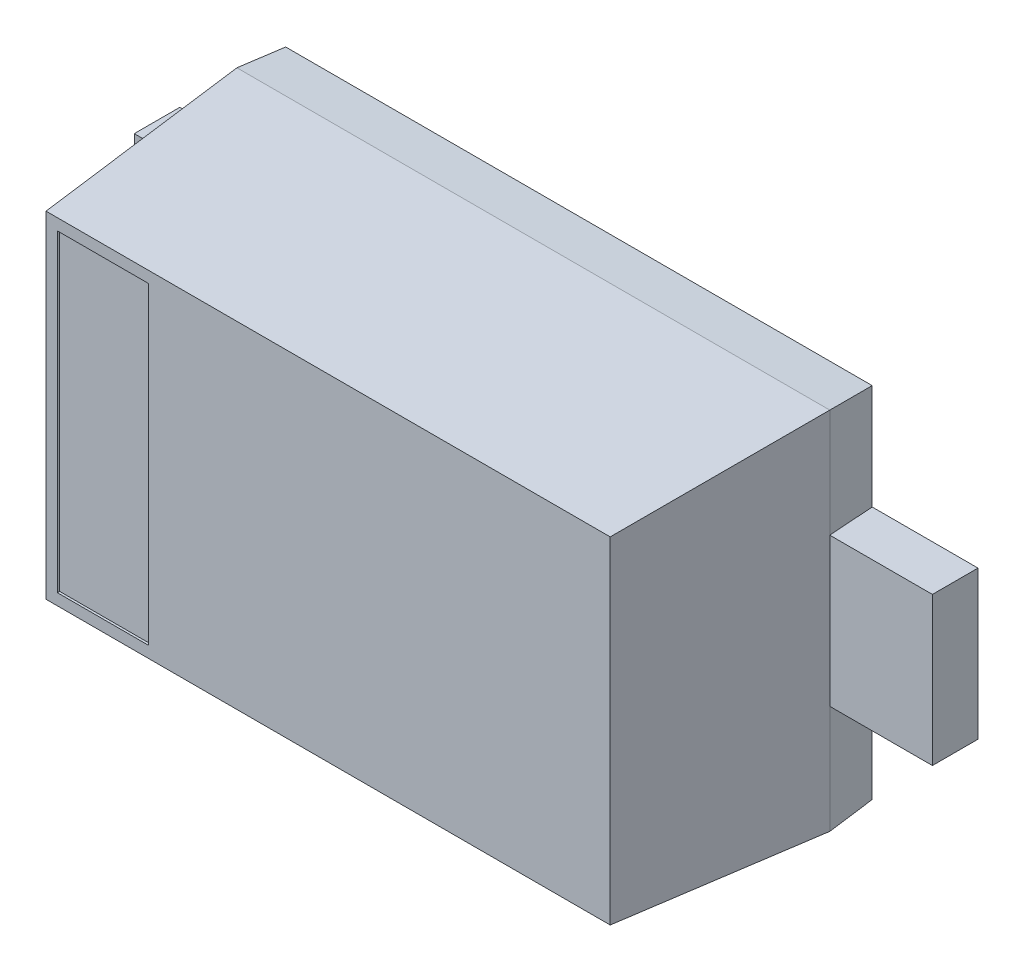
ISO-10303-21;
HEADER;
FILE_DESCRIPTION(('STEP AP214'),'2;1');
FILE_NAME('part.step','',(''),(''),'','','');
FILE_SCHEMA(('AUTOMOTIVE_DESIGN { 1 0 10303 214 1 1 1 1 }'));
ENDSEC;
DATA;
#1=APPLICATION_CONTEXT('core data for automotive mechanical design processes');
#2=APPLICATION_PROTOCOL_DEFINITION('international standard','automotive_design',2000,#1);
#3=PRODUCT_CONTEXT('',#1,'mechanical');
#4=PRODUCT('Part','Part','',(#3));
#5=PRODUCT_RELATED_PRODUCT_CATEGORY('part','',(#4));
#6=PRODUCT_DEFINITION_FORMATION('','',#4);
#7=PRODUCT_DEFINITION_CONTEXT('part definition',#1,'design');
#8=PRODUCT_DEFINITION('design','',#6,#7);
#9=PRODUCT_DEFINITION_SHAPE('','',#8);
#10=(LENGTH_UNIT() NAMED_UNIT(*) SI_UNIT(.MILLI.,.METRE.));
#11=(NAMED_UNIT(*) PLANE_ANGLE_UNIT() SI_UNIT($,.RADIAN.));
#12=(NAMED_UNIT(*) SI_UNIT($,.STERADIAN.) SOLID_ANGLE_UNIT());
#13=UNCERTAINTY_MEASURE_WITH_UNIT(LENGTH_MEASURE(1.E-05),#10,'distance_accuracy_value','');
#14=(GEOMETRIC_REPRESENTATION_CONTEXT(3) GLOBAL_UNCERTAINTY_ASSIGNED_CONTEXT((#13)) GLOBAL_UNIT_ASSIGNED_CONTEXT((#10,
#11,#12)) REPRESENTATION_CONTEXT('',''));
#15=CARTESIAN_POINT('',(0.,0.,0.));
#16=DIRECTION('',(0.,0.,1.));
#17=DIRECTION('',(1.,0.,0.));
#18=AXIS2_PLACEMENT_3D('',#15,#16,#17);
#19=CARTESIAN_POINT('',(-1.187065869251,-0.687065869251,1.09));
#20=DIRECTION('',(0.,0.,1.));
#21=DIRECTION('',(1.,0.,0.));
#22=AXIS2_PLACEMENT_3D('',#19,#20,#21);
#23=PLANE('',#22);
#24=DIRECTION('',(0.,1.,0.));
#25=VECTOR('',#24,1.);
#26=CARTESIAN_POINT('',(-0.787065869251,0.,1.09));
#27=LINE('',#26,#25);
#28=CARTESIAN_POINT('',(-0.787065869251,-0.687065869251,1.09));
#29=VERTEX_POINT('',#28);
#30=CARTESIAN_POINT('',(-0.787065869251,0.687065869251,1.09));
#31=VERTEX_POINT('',#30);
#32=EDGE_CURVE('E238',#29,#31,#27,.T.);
#33=ORIENTED_EDGE('',*,*,#32,.T.);
#34=DIRECTION('',(-1.,0.,0.));
#35=VECTOR('',#34,1.);
#36=CARTESIAN_POINT('',(-0.987065869251,0.687065869251,1.09));
#37=LINE('',#36,#35);
#38=CARTESIAN_POINT('',(-1.187065869251,0.687065869251,1.09));
#39=VERTEX_POINT('',#38);
#40=EDGE_CURVE('E248',#31,#39,#37,.T.);
#41=ORIENTED_EDGE('',*,*,#40,.T.);
#42=DIRECTION('',(0.,1.,0.));
#43=VECTOR('',#42,1.);
#44=CARTESIAN_POINT('',(-1.187065869251,0.,1.09));
#45=LINE('',#44,#43);
#46=CARTESIAN_POINT('',(-1.187065869251,-0.687065869251,1.09));
#47=VERTEX_POINT('',#46);
#48=EDGE_CURVE('E243',#47,#39,#45,.T.);
#49=ORIENTED_EDGE('',*,*,#48,.F.);
#50=DIRECTION('',(1.,0.,0.));
#51=VECTOR('',#50,1.);
#52=CARTESIAN_POINT('',(-0.987065869251,-0.687065869251,1.09));
#53=LINE('',#52,#51);
#54=EDGE_CURVE('E236',#47,#29,#53,.T.);
#55=ORIENTED_EDGE('',*,*,#54,.T.);
#56=EDGE_LOOP('',(#33,#41,#49,#55));
#57=FACE_BOUND('',#56,.T.);
#58=ADVANCED_FACE('F17',(#57),#23,.T.);
#59=CARTESIAN_POINT('',(-0.787065869251,0.687065869251,1.09));
#60=DIRECTION('',(1.,0.,0.));
#61=DIRECTION('',(0.,0.,1.));
#62=AXIS2_PLACEMENT_3D('',#59,#60,#61);
#63=PLANE('',#62);
#64=DIRECTION('',(0.,0.,-1.));
#65=VECTOR('',#64,1.);
#66=CARTESIAN_POINT('',(-0.787065869251,0.687065869251,1.095));
#67=LINE('',#66,#65);
#68=CARTESIAN_POINT('',(-0.787065869251,0.687065869251,1.1));
#69=VERTEX_POINT('',#68);
#70=EDGE_CURVE('E246',#69,#31,#67,.T.);
#71=ORIENTED_EDGE('',*,*,#70,.T.);
#72=ORIENTED_EDGE('',*,*,#32,.F.);
#73=DIRECTION('',(0.,0.,-1.));
#74=VECTOR('',#73,1.);
#75=CARTESIAN_POINT('',(-0.787065869251,-0.687065869251,1.095));
#76=LINE('',#75,#74);
#77=CARTESIAN_POINT('',(-0.787065869251,-0.687065869251,1.1));
#78=VERTEX_POINT('',#77);
#79=EDGE_CURVE('E242',#78,#29,#76,.T.);
#80=ORIENTED_EDGE('',*,*,#79,.F.);
#81=DIRECTION('',(0.,-1.,0.));
#82=VECTOR('',#81,1.);
#83=CARTESIAN_POINT('',(-0.787065869251,0.687065869251,1.1));
#84=LINE('',#83,#82);
#85=EDGE_CURVE('E194',#78,#69,#84,.F.);
#86=ORIENTED_EDGE('',*,*,#85,.T.);
#87=EDGE_LOOP('',(#71,#72,#80,#86));
#88=FACE_BOUND('',#87,.T.);
#89=ADVANCED_FACE('F376',(#88),#63,.F.);
#90=CARTESIAN_POINT('',(-1.187065869251,0.687065869251,1.09));
#91=DIRECTION('',(0.,1.,0.));
#92=DIRECTION('',(0.,0.,1.));
#93=AXIS2_PLACEMENT_3D('',#90,#91,#92);
#94=PLANE('',#93);
#95=DIRECTION('',(0.,0.,1.));
#96=VECTOR('',#95,1.);
#97=CARTESIAN_POINT('',(-1.187065869251,0.687065869251,1.095));
#98=LINE('',#97,#96);
#99=CARTESIAN_POINT('',(-1.187065869251,0.687065869251,1.1));
#100=VERTEX_POINT('',#99);
#101=EDGE_CURVE('E239',#39,#100,#98,.T.);
#102=ORIENTED_EDGE('',*,*,#101,.F.);
#103=ORIENTED_EDGE('',*,*,#40,.F.);
#104=ORIENTED_EDGE('',*,*,#70,.F.);
#105=DIRECTION('',(1.,0.,0.));
#106=VECTOR('',#105,1.);
#107=CARTESIAN_POINT('',(-1.187065869251,0.687065869251,1.1));
#108=LINE('',#107,#106);
#109=EDGE_CURVE('E193',#69,#100,#108,.F.);
#110=ORIENTED_EDGE('',*,*,#109,.T.);
#111=EDGE_LOOP('',(#102,#103,#104,#110));
#112=FACE_BOUND('',#111,.T.);
#113=ADVANCED_FACE('F379',(#112),#94,.F.);
#114=CARTESIAN_POINT('',(-1.187065869251,0.687065869251,1.09));
#115=DIRECTION('',(1.,0.,0.));
#116=DIRECTION('',(0.,0.,1.));
#117=AXIS2_PLACEMENT_3D('',#114,#115,#116);
#118=PLANE('',#117);
#119=ORIENTED_EDGE('',*,*,#101,.T.);
#120=DIRECTION('',(0.,-1.,0.));
#121=VECTOR('',#120,1.);
#122=CARTESIAN_POINT('',(-1.187065869251,0.687065869251,1.1));
#123=LINE('',#122,#121);
#124=CARTESIAN_POINT('',(-1.187065869251,-0.687065869251,1.1));
#125=VERTEX_POINT('',#124);
#126=EDGE_CURVE('E191',#100,#125,#123,.T.);
#127=ORIENTED_EDGE('',*,*,#126,.T.);
#128=DIRECTION('',(0.,0.,1.));
#129=VECTOR('',#128,1.);
#130=CARTESIAN_POINT('',(-1.187065869251,-0.687065869251,1.095));
#131=LINE('',#130,#129);
#132=EDGE_CURVE('E222',#47,#125,#131,.T.);
#133=ORIENTED_EDGE('',*,*,#132,.F.);
#134=ORIENTED_EDGE('',*,*,#48,.T.);
#135=EDGE_LOOP('',(#119,#127,#133,#134));
#136=FACE_BOUND('',#135,.T.);
#137=ADVANCED_FACE('F383',(#136),#118,.T.);
#138=CARTESIAN_POINT('',(-1.187065869251,-0.687065869251,1.09));
#139=DIRECTION('',(0.,1.,0.));
#140=DIRECTION('',(0.,0.,1.));
#141=AXIS2_PLACEMENT_3D('',#138,#139,#140);
#142=PLANE('',#141);
#143=ORIENTED_EDGE('',*,*,#132,.T.);
#144=DIRECTION('',(1.,0.,0.));
#145=VECTOR('',#144,1.);
#146=CARTESIAN_POINT('',(-1.187065869251,-0.687065869251,1.1));
#147=LINE('',#146,#145);
#148=EDGE_CURVE('E187',#125,#78,#147,.T.);
#149=ORIENTED_EDGE('',*,*,#148,.T.);
#150=ORIENTED_EDGE('',*,*,#79,.T.);
#151=ORIENTED_EDGE('',*,*,#54,.F.);
#152=EDGE_LOOP('',(#143,#149,#150,#151));
#153=FACE_BOUND('',#152,.T.);
#154=ADVANCED_FACE('F386',(#153),#142,.T.);
#155=CARTESIAN_POINT('',(-1.3,0.325,0.2));
#156=DIRECTION('',(0.,0.,1.));
#157=DIRECTION('',(-1.,0.,0.));
#158=AXIS2_PLACEMENT_3D('',#155,#156,#157);
#159=PLANE('',#158);
#160=DIRECTION('',(0.,1.,0.));
#161=VECTOR('',#160,1.);
#162=CARTESIAN_POINT('',(-1.75,0.,0.2));
#163=LINE('',#162,#161);
#164=CARTESIAN_POINT('',(-1.75,-0.325,0.2));
#165=VERTEX_POINT('',#164);
#166=CARTESIAN_POINT('',(-1.75,0.325,0.2));
#167=VERTEX_POINT('',#166);
#168=EDGE_CURVE('E214',#165,#167,#163,.T.);
#169=ORIENTED_EDGE('',*,*,#168,.F.);
#170=DIRECTION('',(-1.,0.,0.));
#171=VECTOR('',#170,1.);
#172=CARTESIAN_POINT('',(-1.5180073188055,-0.325,0.2));
#173=LINE('',#172,#171);
#174=CARTESIAN_POINT('',(-1.3,-0.325,0.2));
#175=VERTEX_POINT('',#174);
#176=EDGE_CURVE('E318',#175,#165,#173,.T.);
#177=ORIENTED_EDGE('',*,*,#176,.F.);
#178=DIRECTION('',(0.,-1.,0.));
#179=VECTOR('',#178,1.);
#180=CARTESIAN_POINT('',(-1.3,0.,0.2));
#181=LINE('',#180,#179);
#182=CARTESIAN_POINT('',(-1.3,0.325,0.2));
#183=VERTEX_POINT('',#182);
#184=EDGE_CURVE('E202',#183,#175,#181,.T.);
#185=ORIENTED_EDGE('',*,*,#184,.F.);
#186=DIRECTION('',(-1.,0.,0.));
#187=VECTOR('',#186,1.);
#188=CARTESIAN_POINT('',(-1.5180073188055,0.325,0.2));
#189=LINE('',#188,#187);
#190=EDGE_CURVE('E305',#183,#167,#189,.T.);
#191=ORIENTED_EDGE('',*,*,#190,.T.);
#192=EDGE_LOOP('',(#169,#177,#185,#191));
#193=FACE_BOUND('',#192,.T.);
#194=ADVANCED_FACE('F397',(#193),#159,.T.);
#195=CARTESIAN_POINT('',(-1.3,0.8,0.2));
#196=DIRECTION('',(-0.997564050259837,0.,0.0697564737439496));
#197=DIRECTION('',(0.,-1.,0.));
#198=AXIS2_PLACEMENT_3D('',#195,#196,#197);
#199=PLANE('',#198);
#200=DIRECTION('',(0.,-1.,0.));
#201=VECTOR('',#200,1.);
#202=CARTESIAN_POINT('',(-1.23706586925039,0.8,1.1000000000087));
#203=LINE('',#202,#201);
#204=CARTESIAN_POINT('',(-1.2370658692507,-0.737065869250696,1.10000000000435));
#205=VERTEX_POINT('',#204);
#206=CARTESIAN_POINT('',(-1.2370658692507,0.737065869250696,1.10000000000435));
#207=VERTEX_POINT('',#206);
#208=EDGE_CURVE('E21',#205,#207,#203,.F.);
#209=ORIENTED_EDGE('',*,*,#208,.T.);
#210=DIRECTION('',(0.0695873743164903,-0.0695873743164901,0.995145815783533));
#211=VECTOR('',#210,1.);
#212=CARTESIAN_POINT('',(-1.2685329346255,0.7685329346255,0.65));
#213=LINE('',#212,#211);
#214=CARTESIAN_POINT('',(-1.3,0.8,0.2));
#215=VERTEX_POINT('',#214);
#216=EDGE_CURVE('E225',#215,#207,#213,.T.);
#217=ORIENTED_EDGE('',*,*,#216,.F.);
#218=DIRECTION('',(0.,-1.,0.));
#219=VECTOR('',#218,1.);
#220=CARTESIAN_POINT('',(-1.3,0.,0.2));
#221=LINE('',#220,#219);
#222=EDGE_CURVE('E206',#215,#183,#221,.T.);
#223=ORIENTED_EDGE('',*,*,#222,.T.);
#224=ORIENTED_EDGE('',*,*,#184,.T.);
#225=DIRECTION('',(0.,-1.,0.));
#226=VECTOR('',#225,1.);
#227=CARTESIAN_POINT('',(-1.3,0.,0.2));
#228=LINE('',#227,#226);
#229=CARTESIAN_POINT('',(-1.3,-0.8,0.2));
#230=VERTEX_POINT('',#229);
#231=EDGE_CURVE('E199',#175,#230,#228,.T.);
#232=ORIENTED_EDGE('',*,*,#231,.T.);
#233=DIRECTION('',(-0.0695873743164903,-0.0695873743164901,-0.995145815783533));
#234=VECTOR('',#233,1.);
#235=CARTESIAN_POINT('',(-1.2685329346255,-0.7685329346255,0.65));
#236=LINE('',#235,#234);
#237=EDGE_CURVE('E212',#205,#230,#236,.T.);
#238=ORIENTED_EDGE('',*,*,#237,.F.);
#239=EDGE_LOOP('',(#209,#217,#223,#224,#232,#238));
#240=FACE_BOUND('',#239,.T.);
#241=ADVANCED_FACE('F391',(#240),#199,.T.);
#242=CARTESIAN_POINT('',(-1.885268582799,0.350855152112,1.1));
#243=DIRECTION('',(0.,0.,-1.));
#244=DIRECTION('',(0.859073922076234,0.511851537468197,0.));
#245=AXIS2_PLACEMENT_3D('',#242,#243,#244);
#246=PLANE('',#245);
#247=ORIENTED_EDGE('',*,*,#126,.F.);
#248=ORIENTED_EDGE('',*,*,#109,.F.);
#249=ORIENTED_EDGE('',*,*,#85,.F.);
#250=ORIENTED_EDGE('',*,*,#148,.F.);
#251=EDGE_LOOP('',(#247,#248,#249,#250));
#252=FACE_BOUND('',#251,.T.);
#253=DIRECTION('',(1.,0.,0.));
#254=VECTOR('',#253,1.);
#255=CARTESIAN_POINT('',(0.,0.737065869251,1.1));
#256=LINE('',#255,#254);
#257=CARTESIAN_POINT('',(1.23706586900089,0.737065869250934,1.1));
#258=VERTEX_POINT('',#257);
#259=EDGE_CURVE('E228',#207,#258,#256,.T.);
#260=ORIENTED_EDGE('',*,*,#259,.F.);
#261=ORIENTED_EDGE('',*,*,#208,.F.);
#262=DIRECTION('',(-1.,0.,0.));
#263=VECTOR('',#262,1.);
#264=CARTESIAN_POINT('',(0.,-0.737065869251,1.1));
#265=LINE('',#264,#263);
#266=CARTESIAN_POINT('',(1.23706586912602,-0.737065869251027,1.1));
#267=VERTEX_POINT('',#266);
#268=EDGE_CURVE('E215',#267,#205,#265,.T.);
#269=ORIENTED_EDGE('',*,*,#268,.F.);
#270=DIRECTION('',(0.,-1.,0.));
#271=VECTOR('',#270,1.);
#272=CARTESIAN_POINT('',(1.237065869251,0.,1.1));
#273=LINE('',#272,#271);
#274=EDGE_CURVE('E98',#258,#267,#273,.T.);
#275=ORIENTED_EDGE('',*,*,#274,.F.);
#276=EDGE_LOOP('',(#260,#261,#269,#275));
#277=FACE_BOUND('',#276,.T.);
#278=ADVANCED_FACE('F388',(#252,#277),#246,.F.);
#279=CARTESIAN_POINT('',(1.3,-0.8,0.2));
#280=DIRECTION('',(0.997564050259837,0.,0.0697564737439496));
#281=DIRECTION('',(0.,1.,0.));
#282=AXIS2_PLACEMENT_3D('',#279,#280,#281);
#283=PLANE('',#282);
#284=ORIENTED_EDGE('',*,*,#274,.T.);
#285=DIRECTION('',(-0.0695873743164903,0.0695873743164901,0.995145815783533));
#286=VECTOR('',#285,1.);
#287=CARTESIAN_POINT('',(1.2685329346255,-0.7685329346255,0.65));
#288=LINE('',#287,#286);
#289=CARTESIAN_POINT('',(1.3,-0.8,0.2));
#290=VERTEX_POINT('',#289);
#291=EDGE_CURVE('E253',#290,#267,#288,.T.);
#292=ORIENTED_EDGE('',*,*,#291,.F.);
#293=DIRECTION('',(0.,1.,0.));
#294=VECTOR('',#293,1.);
#295=CARTESIAN_POINT('',(1.3,0.,0.2));
#296=LINE('',#295,#294);
#297=CARTESIAN_POINT('',(1.3,-0.325,0.2));
#298=VERTEX_POINT('',#297);
#299=EDGE_CURVE('E190',#290,#298,#296,.T.);
#300=ORIENTED_EDGE('',*,*,#299,.T.);
#301=DIRECTION('',(0.,-1.,0.));
#302=VECTOR('',#301,1.);
#303=CARTESIAN_POINT('',(1.3,0.,0.2));
#304=LINE('',#303,#302);
#305=CARTESIAN_POINT('',(1.3,0.325,0.2));
#306=VERTEX_POINT('',#305);
#307=EDGE_CURVE('E327',#306,#298,#304,.T.);
#308=ORIENTED_EDGE('',*,*,#307,.F.);
#309=DIRECTION('',(0.,1.,0.));
#310=VECTOR('',#309,1.);
#311=CARTESIAN_POINT('',(1.3,0.,0.2));
#312=LINE('',#311,#310);
#313=CARTESIAN_POINT('',(1.3,0.8,0.2));
#314=VERTEX_POINT('',#313);
#315=EDGE_CURVE('E335',#306,#314,#312,.T.);
#316=ORIENTED_EDGE('',*,*,#315,.T.);
#317=DIRECTION('',(0.0695873743164903,0.0695873743164901,-0.995145815783533));
#318=VECTOR('',#317,1.);
#319=CARTESIAN_POINT('',(1.2685329346255,0.7685329346255,0.65));
#320=LINE('',#319,#318);
#321=EDGE_CURVE('E255',#258,#314,#320,.T.);
#322=ORIENTED_EDGE('',*,*,#321,.F.);
#323=EDGE_LOOP('',(#284,#292,#300,#308,#316,#322));
#324=FACE_BOUND('',#323,.T.);
#325=ADVANCED_FACE('F390',(#324),#283,.T.);
#326=CARTESIAN_POINT('',(1.3,-0.325,0.2));
#327=DIRECTION('',(0.,0.,1.));
#328=DIRECTION('',(1.,0.,0.));
#329=AXIS2_PLACEMENT_3D('',#326,#327,#328);
#330=PLANE('',#329);
#331=DIRECTION('',(0.,-1.,0.));
#332=VECTOR('',#331,1.);
#333=CARTESIAN_POINT('',(1.75,0.,0.2));
#334=LINE('',#333,#332);
#335=CARTESIAN_POINT('',(1.75,0.325,0.2));
#336=VERTEX_POINT('',#335);
#337=CARTESIAN_POINT('',(1.75,-0.325,0.2));
#338=VERTEX_POINT('',#337);
#339=EDGE_CURVE('E298',#336,#338,#334,.T.);
#340=ORIENTED_EDGE('',*,*,#339,.F.);
#341=DIRECTION('',(1.,0.,0.));
#342=VECTOR('',#341,1.);
#343=CARTESIAN_POINT('',(1.5180073188055,0.325,0.2));
#344=LINE('',#343,#342);
#345=EDGE_CURVE('E294',#306,#336,#344,.T.);
#346=ORIENTED_EDGE('',*,*,#345,.F.);
#347=ORIENTED_EDGE('',*,*,#307,.T.);
#348=DIRECTION('',(1.,0.,0.));
#349=VECTOR('',#348,1.);
#350=CARTESIAN_POINT('',(1.5180073188055,-0.325,0.2));
#351=LINE('',#350,#349);
#352=EDGE_CURVE('E331',#298,#338,#351,.T.);
#353=ORIENTED_EDGE('',*,*,#352,.T.);
#354=EDGE_LOOP('',(#340,#346,#347,#353));
#355=FACE_BOUND('',#354,.T.);
#356=ADVANCED_FACE('F449',(#355),#330,.T.);
#357=CARTESIAN_POINT('',(-1.3,-0.8,0.2));
#358=DIRECTION('',(0.,-0.997564050259837,0.0697564737439495));
#359=DIRECTION('',(1.,0.,0.));
#360=AXIS2_PLACEMENT_3D('',#357,#358,#359);
#361=PLANE('',#360);
#362=ORIENTED_EDGE('',*,*,#268,.T.);
#363=ORIENTED_EDGE('',*,*,#237,.T.);
#364=DIRECTION('',(-1.,0.,0.));
#365=VECTOR('',#364,1.);
#366=CARTESIAN_POINT('',(0.,-0.8,0.2));
#367=LINE('',#366,#365);
#368=EDGE_CURVE('E155',#290,#230,#367,.T.);
#369=ORIENTED_EDGE('',*,*,#368,.F.);
#370=ORIENTED_EDGE('',*,*,#291,.T.);
#371=EDGE_LOOP('',(#362,#363,#369,#370));
#372=FACE_BOUND('',#371,.T.);
#373=ADVANCED_FACE('F461',(#372),#361,.T.);
#374=CARTESIAN_POINT('',(-1.75,-0.325,0.));
#375=DIRECTION('',(-1.,0.,0.));
#376=DIRECTION('',(0.,0.,1.));
#377=AXIS2_PLACEMENT_3D('',#374,#375,#376);
#378=PLANE('',#377);
#379=DIRECTION('',(0.,0.,-1.));
#380=VECTOR('',#379,1.);
#381=CARTESIAN_POINT('',(-1.75,-0.325,0.1));
#382=LINE('',#381,#380);
#383=CARTESIAN_POINT('',(-1.75,-0.325,0.));
#384=VERTEX_POINT('',#383);
#385=EDGE_CURVE('E307',#165,#384,#382,.T.);
#386=ORIENTED_EDGE('',*,*,#385,.F.);
#387=ORIENTED_EDGE('',*,*,#168,.T.);
#388=DIRECTION('',(0.,0.,-1.));
#389=VECTOR('',#388,1.);
#390=CARTESIAN_POINT('',(-1.75,0.325,0.1));
#391=LINE('',#390,#389);
#392=CARTESIAN_POINT('',(-1.75,0.325,0.));
#393=VERTEX_POINT('',#392);
#394=EDGE_CURVE('E229',#167,#393,#391,.T.);
#395=ORIENTED_EDGE('',*,*,#394,.T.);
#396=DIRECTION('',(0.,-1.,0.));
#397=VECTOR('',#396,1.);
#398=CARTESIAN_POINT('',(-1.75,0.,0.));
#399=LINE('',#398,#397);
#400=EDGE_CURVE('E302',#393,#384,#399,.T.);
#401=ORIENTED_EDGE('',*,*,#400,.T.);
#402=EDGE_LOOP('',(#386,#387,#395,#401));
#403=FACE_BOUND('',#402,.T.);
#404=ADVANCED_FACE('F402',(#403),#378,.T.);
#405=CARTESIAN_POINT('',(-1.286014637611,-0.325,0.));
#406=DIRECTION('',(0.,-1.,0.));
#407=DIRECTION('',(0.,0.,1.));
#408=AXIS2_PLACEMENT_3D('',#405,#406,#407);
#409=PLANE('',#408);
#410=ORIENTED_EDGE('',*,*,#176,.T.);
#411=ORIENTED_EDGE('',*,*,#385,.T.);
#412=DIRECTION('',(1.,0.,0.));
#413=VECTOR('',#412,1.);
#414=CARTESIAN_POINT('',(-1.5180073188055,-0.325,0.));
#415=LINE('',#414,#413);
#416=CARTESIAN_POINT('',(-1.286014637611,-0.325,0.));
#417=VERTEX_POINT('',#416);
#418=EDGE_CURVE('E185',#384,#417,#415,.T.);
#419=ORIENTED_EDGE('',*,*,#418,.T.);
#420=DIRECTION('',(-0.0697564737456045,0.,0.997564050259721));
#421=VECTOR('',#420,1.);
#422=CARTESIAN_POINT('',(-1.286014637611,-0.325,0.));
#423=LINE('',#422,#421);
#424=EDGE_CURVE('E158',#175,#417,#423,.F.);
#425=ORIENTED_EDGE('',*,*,#424,.F.);
#426=EDGE_LOOP('',(#410,#411,#419,#425));
#427=FACE_BOUND('',#426,.T.);
#428=ADVANCED_FACE('F400',(#427),#409,.T.);
#429=CARTESIAN_POINT('',(-1.286014637611,0.325,0.));
#430=DIRECTION('',(0.,-1.,0.));
#431=DIRECTION('',(0.,0.,1.));
#432=AXIS2_PLACEMENT_3D('',#429,#430,#431);
#433=PLANE('',#432);
#434=ORIENTED_EDGE('',*,*,#190,.F.);
#435=DIRECTION('',(-0.0697564737456045,0.,0.997564050259721));
#436=VECTOR('',#435,1.);
#437=CARTESIAN_POINT('',(-1.286014637611,0.325,0.));
#438=LINE('',#437,#436);
#439=CARTESIAN_POINT('',(-1.286014637611,0.325,0.));
#440=VERTEX_POINT('',#439);
#441=EDGE_CURVE('E181',#440,#183,#438,.T.);
#442=ORIENTED_EDGE('',*,*,#441,.F.);
#443=DIRECTION('',(-1.,0.,0.));
#444=VECTOR('',#443,1.);
#445=CARTESIAN_POINT('',(-1.5180073188055,0.325,0.));
#446=LINE('',#445,#444);
#447=EDGE_CURVE('E157',#440,#393,#446,.T.);
#448=ORIENTED_EDGE('',*,*,#447,.T.);
#449=ORIENTED_EDGE('',*,*,#394,.F.);
#450=EDGE_LOOP('',(#434,#442,#448,#449));
#451=FACE_BOUND('',#450,.T.);
#452=ADVANCED_FACE('F405',(#451),#433,.F.);
#453=CARTESIAN_POINT('',(1.3,0.8,0.2));
#454=DIRECTION('',(0.,0.997564050259837,0.0697564737439495));
#455=DIRECTION('',(-1.,0.,0.));
#456=AXIS2_PLACEMENT_3D('',#453,#454,#455);
#457=PLANE('',#456);
#458=ORIENTED_EDGE('',*,*,#259,.T.);
#459=ORIENTED_EDGE('',*,*,#321,.T.);
#460=DIRECTION('',(1.,0.,0.));
#461=VECTOR('',#460,1.);
#462=CARTESIAN_POINT('',(0.,0.8,0.2));
#463=LINE('',#462,#461);
#464=EDGE_CURVE('E180',#215,#314,#463,.T.);
#465=ORIENTED_EDGE('',*,*,#464,.F.);
#466=ORIENTED_EDGE('',*,*,#216,.T.);
#467=EDGE_LOOP('',(#458,#459,#465,#466));
#468=FACE_BOUND('',#467,.T.);
#469=ADVANCED_FACE('F394',(#468),#457,.T.);
#470=CARTESIAN_POINT('',(1.75,0.325,0.));
#471=DIRECTION('',(1.,0.,0.));
#472=DIRECTION('',(0.,0.,1.));
#473=AXIS2_PLACEMENT_3D('',#470,#471,#472);
#474=PLANE('',#473);
#475=DIRECTION('',(0.,0.,-1.));
#476=VECTOR('',#475,1.);
#477=CARTESIAN_POINT('',(1.75,0.325,0.1));
#478=LINE('',#477,#476);
#479=CARTESIAN_POINT('',(1.75,0.325,0.));
#480=VERTEX_POINT('',#479);
#481=EDGE_CURVE('E297',#336,#480,#478,.T.);
#482=ORIENTED_EDGE('',*,*,#481,.F.);
#483=ORIENTED_EDGE('',*,*,#339,.T.);
#484=DIRECTION('',(0.,0.,-1.));
#485=VECTOR('',#484,1.);
#486=CARTESIAN_POINT('',(1.75,-0.325,0.1));
#487=LINE('',#486,#485);
#488=CARTESIAN_POINT('',(1.75,-0.325,0.));
#489=VERTEX_POINT('',#488);
#490=EDGE_CURVE('E364',#338,#489,#487,.T.);
#491=ORIENTED_EDGE('',*,*,#490,.T.);
#492=DIRECTION('',(0.,1.,0.));
#493=VECTOR('',#492,1.);
#494=CARTESIAN_POINT('',(1.75,0.,0.));
#495=LINE('',#494,#493);
#496=EDGE_CURVE('E284',#489,#480,#495,.T.);
#497=ORIENTED_EDGE('',*,*,#496,.T.);
#498=EDGE_LOOP('',(#482,#483,#491,#497));
#499=FACE_BOUND('',#498,.T.);
#500=ADVANCED_FACE('F413',(#499),#474,.T.);
#501=CARTESIAN_POINT('',(1.286014637611,0.325,0.));
#502=DIRECTION('',(0.,1.,0.));
#503=DIRECTION('',(0.,0.,1.));
#504=AXIS2_PLACEMENT_3D('',#501,#502,#503);
#505=PLANE('',#504);
#506=ORIENTED_EDGE('',*,*,#345,.T.);
#507=ORIENTED_EDGE('',*,*,#481,.T.);
#508=DIRECTION('',(-1.,0.,0.));
#509=VECTOR('',#508,1.);
#510=CARTESIAN_POINT('',(1.5180073188055,0.325,0.));
#511=LINE('',#510,#509);
#512=CARTESIAN_POINT('',(1.286014637611,0.325,0.));
#513=VERTEX_POINT('',#512);
#514=EDGE_CURVE('E282',#480,#513,#511,.T.);
#515=ORIENTED_EDGE('',*,*,#514,.T.);
#516=DIRECTION('',(0.0697564737456045,0.,0.997564050259721));
#517=VECTOR('',#516,1.);
#518=CARTESIAN_POINT('',(1.286014637611,0.325,0.));
#519=LINE('',#518,#517);
#520=EDGE_CURVE('E176',#306,#513,#519,.F.);
#521=ORIENTED_EDGE('',*,*,#520,.F.);
#522=EDGE_LOOP('',(#506,#507,#515,#521));
#523=FACE_BOUND('',#522,.T.);
#524=ADVANCED_FACE('F438',(#523),#505,.T.);
#525=CARTESIAN_POINT('',(1.286014637611,-0.325,0.));
#526=DIRECTION('',(0.,1.,0.));
#527=DIRECTION('',(0.,0.,1.));
#528=AXIS2_PLACEMENT_3D('',#525,#526,#527);
#529=PLANE('',#528);
#530=ORIENTED_EDGE('',*,*,#352,.F.);
#531=DIRECTION('',(0.0697564737456045,0.,0.997564050259721));
#532=VECTOR('',#531,1.);
#533=CARTESIAN_POINT('',(1.286014637611,-0.325,0.));
#534=LINE('',#533,#532);
#535=CARTESIAN_POINT('',(1.286014637611,-0.325,0.));
#536=VERTEX_POINT('',#535);
#537=EDGE_CURVE('E36',#536,#298,#534,.T.);
#538=ORIENTED_EDGE('',*,*,#537,.F.);
#539=DIRECTION('',(1.,0.,0.));
#540=VECTOR('',#539,1.);
#541=CARTESIAN_POINT('',(1.5180073188055,-0.325,0.));
#542=LINE('',#541,#540);
#543=EDGE_CURVE('E276',#536,#489,#542,.T.);
#544=ORIENTED_EDGE('',*,*,#543,.T.);
#545=ORIENTED_EDGE('',*,*,#490,.F.);
#546=EDGE_LOOP('',(#530,#538,#544,#545));
#547=FACE_BOUND('',#546,.T.);
#548=ADVANCED_FACE('F435',(#547),#529,.F.);
#549=CARTESIAN_POINT('',(-1.286014637611,-0.786014637611,0.));
#550=DIRECTION('',(0.,-0.997564050259721,-0.069756473745604));
#551=DIRECTION('',(1.,0.,0.));
#552=AXIS2_PLACEMENT_3D('',#549,#550,#551);
#553=PLANE('',#552);
#554=ORIENTED_EDGE('',*,*,#368,.T.);
#555=DIRECTION('',(-0.0695873743181331,-0.0695873743181326,0.995145815783303));
#556=VECTOR('',#555,1.);
#557=CARTESIAN_POINT('',(-1.2930073188055,-0.7930073188055,0.1));
#558=LINE('',#557,#556);
#559=CARTESIAN_POINT('',(-1.28601463761111,-0.786014637611102,0.));
#560=VERTEX_POINT('',#559);
#561=EDGE_CURVE('E151',#560,#230,#558,.T.);
#562=ORIENTED_EDGE('',*,*,#561,.F.);
#563=DIRECTION('',(-1.,0.,0.));
#564=VECTOR('',#563,1.);
#565=CARTESIAN_POINT('',(1.28601463761121,-0.786014637611352,0.));
#566=LINE('',#565,#564);
#567=CARTESIAN_POINT('',(1.28601463761116,-0.786014637611176,0.));
#568=VERTEX_POINT('',#567);
#569=EDGE_CURVE('E147',#568,#560,#566,.T.);
#570=ORIENTED_EDGE('',*,*,#569,.F.);
#571=DIRECTION('',(-0.0695873743181331,0.0695873743181326,-0.995145815783303));
#572=VECTOR('',#571,1.);
#573=CARTESIAN_POINT('',(1.2930073188055,-0.7930073188055,0.1));
#574=LINE('',#573,#572);
#575=EDGE_CURVE('E172',#290,#568,#574,.T.);
#576=ORIENTED_EDGE('',*,*,#575,.F.);
#577=EDGE_LOOP('',(#554,#562,#570,#576));
#578=FACE_BOUND('',#577,.T.);
#579=ADVANCED_FACE('F153',(#578),#553,.T.);
#580=CARTESIAN_POINT('',(-1.286014637611,0.786014637611,0.));
#581=DIRECTION('',(-0.997564050259721,0.,-0.0697564737456045));
#582=DIRECTION('',(0.,-1.,0.));
#583=AXIS2_PLACEMENT_3D('',#580,#581,#582);
#584=PLANE('',#583);
#585=ORIENTED_EDGE('',*,*,#561,.T.);
#586=ORIENTED_EDGE('',*,*,#231,.F.);
#587=ORIENTED_EDGE('',*,*,#424,.T.);
#588=DIRECTION('',(4.82583995481907E-13,1.,0.));
#589=VECTOR('',#588,1.);
#590=CARTESIAN_POINT('',(-1.28601463761122,-0.786014637611136,0.));
#591=LINE('',#590,#589);
#592=EDGE_CURVE('E162',#560,#417,#591,.T.);
#593=ORIENTED_EDGE('',*,*,#592,.F.);
#594=EDGE_LOOP('',(#585,#586,#587,#593));
#595=FACE_BOUND('',#594,.T.);
#596=ADVANCED_FACE('F163',(#595),#584,.T.);
#597=CARTESIAN_POINT('',(-1.286014637611,0.786014637611,0.));
#598=DIRECTION('',(-0.997564050259721,0.,-0.0697564737456045));
#599=DIRECTION('',(0.,-1.,0.));
#600=AXIS2_PLACEMENT_3D('',#597,#598,#599);
#601=PLANE('',#600);
#602=ORIENTED_EDGE('',*,*,#441,.T.);
#603=ORIENTED_EDGE('',*,*,#222,.F.);
#604=DIRECTION('',(-0.0695873743181331,0.0695873743181326,0.995145815783303));
#605=VECTOR('',#604,1.);
#606=CARTESIAN_POINT('',(-1.2930073188055,0.7930073188055,0.1));
#607=LINE('',#606,#605);
#608=CARTESIAN_POINT('',(-1.28601463761116,0.786014637611176,0.));
#609=VERTEX_POINT('',#608);
#610=EDGE_CURVE('E184',#609,#215,#607,.T.);
#611=ORIENTED_EDGE('',*,*,#610,.F.);
#612=DIRECTION('',(-4.66121578481819E-13,1.,0.));
#613=VECTOR('',#612,1.);
#614=CARTESIAN_POINT('',(-1.286014637611,0.325,0.));
#615=LINE('',#614,#613);
#616=EDGE_CURVE('E167',#440,#609,#615,.T.);
#617=ORIENTED_EDGE('',*,*,#616,.F.);
#618=EDGE_LOOP('',(#602,#603,#611,#617));
#619=FACE_BOUND('',#618,.T.);
#620=ADVANCED_FACE('F267',(#619),#601,.T.);
#621=CARTESIAN_POINT('',(1.286014637611,0.786014637611,0.));
#622=DIRECTION('',(0.,0.997564050259721,-0.069756473745604));
#623=DIRECTION('',(-1.,0.,0.));
#624=AXIS2_PLACEMENT_3D('',#621,#622,#623);
#625=PLANE('',#624);
#626=ORIENTED_EDGE('',*,*,#464,.T.);
#627=DIRECTION('',(0.0695873743181331,0.0695873743181326,0.995145815783303));
#628=VECTOR('',#627,1.);
#629=CARTESIAN_POINT('',(1.2930073188055,0.7930073188055,0.1));
#630=LINE('',#629,#628);
#631=CARTESIAN_POINT('',(1.28601463761111,0.786014637611102,0.));
#632=VERTEX_POINT('',#631);
#633=EDGE_CURVE('E179',#632,#314,#630,.T.);
#634=ORIENTED_EDGE('',*,*,#633,.F.);
#635=DIRECTION('',(1.,0.,0.));
#636=VECTOR('',#635,1.);
#637=CARTESIAN_POINT('',(-1.28601463761121,0.786014637611352,0.));
#638=LINE('',#637,#636);
#639=EDGE_CURVE('E258',#609,#632,#638,.T.);
#640=ORIENTED_EDGE('',*,*,#639,.F.);
#641=ORIENTED_EDGE('',*,*,#610,.T.);
#642=EDGE_LOOP('',(#626,#634,#640,#641));
#643=FACE_BOUND('',#642,.T.);
#644=ADVANCED_FACE('F271',(#643),#625,.T.);
#645=CARTESIAN_POINT('',(1.286014637611,-0.786014637611,0.));
#646=DIRECTION('',(0.997564050259721,0.,-0.0697564737456045));
#647=DIRECTION('',(0.,1.,0.));
#648=AXIS2_PLACEMENT_3D('',#645,#646,#647);
#649=PLANE('',#648);
#650=ORIENTED_EDGE('',*,*,#633,.T.);
#651=ORIENTED_EDGE('',*,*,#315,.F.);
#652=ORIENTED_EDGE('',*,*,#520,.T.);
#653=DIRECTION('',(-4.83995059796182E-13,-1.,0.));
#654=VECTOR('',#653,1.);
#655=CARTESIAN_POINT('',(1.28601463761122,0.786014637611136,0.));
#656=LINE('',#655,#654);
#657=EDGE_CURVE('E27',#632,#513,#656,.T.);
#658=ORIENTED_EDGE('',*,*,#657,.F.);
#659=EDGE_LOOP('',(#650,#651,#652,#658));
#660=FACE_BOUND('',#659,.T.);
#661=ADVANCED_FACE('F278',(#660),#649,.T.);
#662=CARTESIAN_POINT('',(1.286014637611,-0.786014637611,0.));
#663=DIRECTION('',(0.997564050259721,0.,-0.0697564737456045));
#664=DIRECTION('',(0.,1.,0.));
#665=AXIS2_PLACEMENT_3D('',#662,#663,#664);
#666=PLANE('',#665);
#667=ORIENTED_EDGE('',*,*,#537,.T.);
#668=ORIENTED_EDGE('',*,*,#299,.F.);
#669=ORIENTED_EDGE('',*,*,#575,.T.);
#670=DIRECTION('',(4.66591933253243E-13,-1.,0.));
#671=VECTOR('',#670,1.);
#672=CARTESIAN_POINT('',(1.286014637611,-0.325,0.));
#673=LINE('',#672,#671);
#674=EDGE_CURVE('E11',#536,#568,#673,.T.);
#675=ORIENTED_EDGE('',*,*,#674,.F.);
#676=EDGE_LOOP('',(#667,#668,#669,#675));
#677=FACE_BOUND('',#676,.T.);
#678=ADVANCED_FACE('F417',(#677),#666,.T.);
#679=CARTESIAN_POINT('',(-1.985526764088,0.358471470903,0.));
#680=DIRECTION('',(0.,0.,-1.));
#681=DIRECTION('',(0.853247349970274,0.521506433103854,0.));
#682=AXIS2_PLACEMENT_3D('',#679,#680,#681);
#683=PLANE('',#682);
#684=ORIENTED_EDGE('',*,*,#657,.T.);
#685=ORIENTED_EDGE('',*,*,#514,.F.);
#686=ORIENTED_EDGE('',*,*,#496,.F.);
#687=ORIENTED_EDGE('',*,*,#543,.F.);
#688=ORIENTED_EDGE('',*,*,#674,.T.);
#689=ORIENTED_EDGE('',*,*,#569,.T.);
#690=ORIENTED_EDGE('',*,*,#592,.T.);
#691=ORIENTED_EDGE('',*,*,#418,.F.);
#692=ORIENTED_EDGE('',*,*,#400,.F.);
#693=ORIENTED_EDGE('',*,*,#447,.F.);
#694=ORIENTED_EDGE('',*,*,#616,.T.);
#695=ORIENTED_EDGE('',*,*,#639,.T.);
#696=EDGE_LOOP('',(#684,#685,#686,#687,#688,#689,#690,#691,#692,#693,#694,#695));
#697=FACE_BOUND('',#696,.T.);
#698=ADVANCED_FACE('F19',(#697),#683,.T.);
#699=CLOSED_SHELL('',(#58,#89,#113,#137,#154,#194,#241,#278,#325,#356,#373,#404,#428,#452,#469,
#500,#524,#548,#579,#596,#620,#644,#661,#678,#698));
#700=MANIFOLD_SOLID_BREP('B1',#699);
#701=ADVANCED_BREP_SHAPE_REPRESENTATION('',(#18,#700),#14);
#702=SHAPE_DEFINITION_REPRESENTATION(#9,#701);
ENDSEC;
END-ISO-10303-21;
